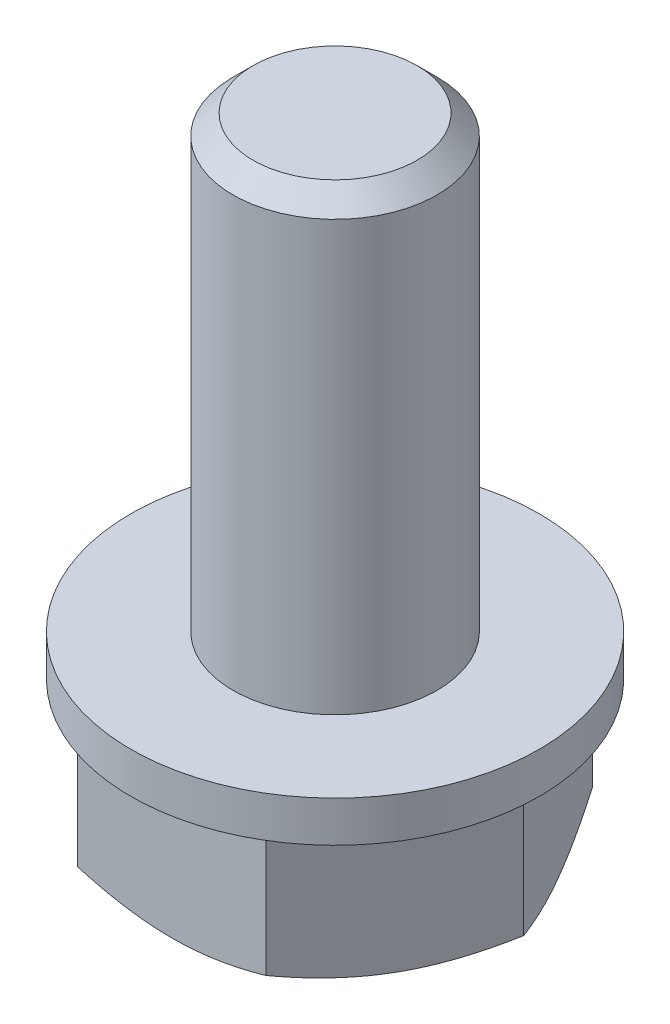
ISO-10303-21;
HEADER;
FILE_DESCRIPTION(('STEP AP214'),'2;1');
FILE_NAME('part.step','',(''),(''),'','','');
FILE_SCHEMA(('AUTOMOTIVE_DESIGN { 1 0 10303 214 1 1 1 1 }'));
ENDSEC;
DATA;
#1=APPLICATION_CONTEXT('core data for automotive mechanical design processes');
#2=APPLICATION_PROTOCOL_DEFINITION('international standard','automotive_design',2000,#1);
#3=PRODUCT_CONTEXT('',#1,'mechanical');
#4=PRODUCT('Part','Part','',(#3));
#5=PRODUCT_RELATED_PRODUCT_CATEGORY('part','',(#4));
#6=PRODUCT_DEFINITION_FORMATION('','',#4);
#7=PRODUCT_DEFINITION_CONTEXT('part definition',#1,'design');
#8=PRODUCT_DEFINITION('design','',#6,#7);
#9=PRODUCT_DEFINITION_SHAPE('','',#8);
#10=(LENGTH_UNIT() NAMED_UNIT(*) SI_UNIT(.MILLI.,.METRE.));
#11=(NAMED_UNIT(*) PLANE_ANGLE_UNIT() SI_UNIT($,.RADIAN.));
#12=(NAMED_UNIT(*) SI_UNIT($,.STERADIAN.) SOLID_ANGLE_UNIT());
#13=UNCERTAINTY_MEASURE_WITH_UNIT(LENGTH_MEASURE(1.E-05),#10,'distance_accuracy_value','');
#14=(GEOMETRIC_REPRESENTATION_CONTEXT(3) GLOBAL_UNCERTAINTY_ASSIGNED_CONTEXT((#13)) GLOBAL_UNIT_ASSIGNED_CONTEXT((#10,
#11,#12)) REPRESENTATION_CONTEXT('',''));
#15=CARTESIAN_POINT('',(0.,0.,0.));
#16=DIRECTION('',(0.,0.,1.));
#17=DIRECTION('',(1.,0.,0.));
#18=AXIS2_PLACEMENT_3D('',#15,#16,#17);
#19=CARTESIAN_POINT('',(12.374368670765,-45.18,-14.374368670765));
#20=DIRECTION('',(0.,-1.,0.));
#21=DIRECTION('',(0.,0.,-1.));
#22=AXIS2_PLACEMENT_3D('',#19,#20,#21);
#23=PLANE('',#22);
#24=CARTESIAN_POINT('',(12.374368670765,-45.18,-12.374368670765));
#25=DIRECTION('',(0.,-1.,0.));
#26=DIRECTION('',(0.,0.,-1.));
#27=AXIS2_PLACEMENT_3D('',#24,#25,#26);
#28=CIRCLE('',#27,4.);
#29=CARTESIAN_POINT('',(12.374368670765,-45.18,-16.374368670765));
#30=VERTEX_POINT('',#29);
#31=CARTESIAN_POINT('',(15.8384702859027,-45.18,-14.374368670765));
#32=VERTEX_POINT('',#31);
#33=EDGE_CURVE('E162',#30,#32,#28,.T.);
#34=ORIENTED_EDGE('',*,*,#33,.T.);
#35=CARTESIAN_POINT('',(12.374368670765,-45.18,-12.374368670765));
#36=DIRECTION('',(0.,-1.,0.));
#37=DIRECTION('',(0.,0.,-1.));
#38=AXIS2_PLACEMENT_3D('',#35,#36,#37);
#39=CIRCLE('',#38,4.);
#40=CARTESIAN_POINT('',(15.8384702859027,-45.18,-10.374368670765));
#41=VERTEX_POINT('',#40);
#42=EDGE_CURVE('E20',#32,#41,#39,.T.);
#43=ORIENTED_EDGE('',*,*,#42,.T.);
#44=CARTESIAN_POINT('',(12.374368670765,-45.18,-12.374368670765));
#45=DIRECTION('',(0.,-1.,0.));
#46=DIRECTION('',(0.,0.,-1.));
#47=AXIS2_PLACEMENT_3D('',#44,#45,#46);
#48=CIRCLE('',#47,4.);
#49=CARTESIAN_POINT('',(12.374368670765,-45.18,-8.374368670765));
#50=VERTEX_POINT('',#49);
#51=EDGE_CURVE('E130',#41,#50,#48,.T.);
#52=ORIENTED_EDGE('',*,*,#51,.T.);
#53=CARTESIAN_POINT('',(12.374368670765,-45.18,-12.374368670765));
#54=DIRECTION('',(0.,-1.,0.));
#55=DIRECTION('',(0.,0.,-1.));
#56=AXIS2_PLACEMENT_3D('',#53,#54,#55);
#57=CIRCLE('',#56,4.);
#58=CARTESIAN_POINT('',(8.91026705562725,-45.18,-10.374368670765));
#59=VERTEX_POINT('',#58);
#60=EDGE_CURVE('E101',#50,#59,#57,.T.);
#61=ORIENTED_EDGE('',*,*,#60,.T.);
#62=CARTESIAN_POINT('',(12.374368670765,-45.18,-12.374368670765));
#63=DIRECTION('',(0.,-1.,0.));
#64=DIRECTION('',(0.,0.,-1.));
#65=AXIS2_PLACEMENT_3D('',#62,#63,#64);
#66=CIRCLE('',#65,4.);
#67=CARTESIAN_POINT('',(8.91026705562725,-45.18,-14.374368670765));
#68=VERTEX_POINT('',#67);
#69=EDGE_CURVE('E149',#59,#68,#66,.T.);
#70=ORIENTED_EDGE('',*,*,#69,.T.);
#71=CARTESIAN_POINT('',(12.374368670765,-45.18,-12.374368670765));
#72=DIRECTION('',(0.,-1.,0.));
#73=DIRECTION('',(0.,0.,-1.));
#74=AXIS2_PLACEMENT_3D('',#71,#72,#73);
#75=CIRCLE('',#74,4.);
#76=EDGE_CURVE('E49',#68,#30,#75,.T.);
#77=ORIENTED_EDGE('',*,*,#76,.T.);
#78=EDGE_LOOP('',(#34,#43,#52,#61,#70,#77));
#79=FACE_BOUND('',#78,.T.);
#80=ADVANCED_FACE('F16',(#79),#23,.T.);
#81=CARTESIAN_POINT('',(12.374368670765,-42.6413248654052,-12.374368670765));
#82=DIRECTION('',(0.,1.,0.));
#83=DIRECTION('',(0.,0.,-1.));
#84=AXIS2_PLACEMENT_3D('',#81,#82,#83);
#85=CYLINDRICAL_SURFACE('',#84,5.);
#86=CARTESIAN_POINT('',(12.374368670765,-40.68,-12.374368670765));
#87=DIRECTION('',(0.,-1.,0.));
#88=DIRECTION('',(0.,0.,-1.));
#89=AXIS2_PLACEMENT_3D('',#86,#87,#88);
#90=CIRCLE('',#89,5.);
#91=CARTESIAN_POINT('',(12.374368670765,-40.68,-17.374368670765));
#92=VERTEX_POINT('',#91);
#93=EDGE_CURVE('E11',#92,#92,#90,.T.);
#94=ORIENTED_EDGE('',*,*,#93,.T.);
#95=EDGE_LOOP('',(#94));
#96=FACE_BOUND('',#95,.T.);
#97=CARTESIAN_POINT('',(12.374368670765,-41.68,-12.374368670765));
#98=DIRECTION('',(0.,1.,0.));
#99=DIRECTION('',(0.,0.,-1.));
#100=AXIS2_PLACEMENT_3D('',#97,#98,#99);
#101=CIRCLE('',#100,5.);
#102=CARTESIAN_POINT('',(12.374368670765,-41.68,-17.374368670765));
#103=VERTEX_POINT('',#102);
#104=EDGE_CURVE('E147',#103,#103,#101,.T.);
#105=ORIENTED_EDGE('',*,*,#104,.T.);
#106=EDGE_LOOP('',(#105));
#107=FACE_BOUND('',#106,.T.);
#108=ADVANCED_FACE('F296',(#96,#107),#85,.T.);
#109=CARTESIAN_POINT('',(12.374368670765,-40.68,-16.124368670765));
#110=DIRECTION('',(0.,1.,0.));
#111=DIRECTION('',(0.,0.,1.));
#112=AXIS2_PLACEMENT_3D('',#109,#110,#111);
#113=PLANE('',#112);
#114=CARTESIAN_POINT('',(12.374368670765,-40.68,-12.374368670765));
#115=DIRECTION('',(0.,-1.,0.));
#116=DIRECTION('',(0.,0.,-1.));
#117=AXIS2_PLACEMENT_3D('',#114,#115,#116);
#118=CIRCLE('',#117,2.5);
#119=CARTESIAN_POINT('',(12.374368670765,-40.68,-14.874368670765));
#120=VERTEX_POINT('',#119);
#121=EDGE_CURVE('E26',#120,#120,#118,.T.);
#122=ORIENTED_EDGE('',*,*,#121,.T.);
#123=EDGE_LOOP('',(#122));
#124=FACE_BOUND('',#123,.T.);
#125=ORIENTED_EDGE('',*,*,#93,.F.);
#126=EDGE_LOOP('',(#125));
#127=FACE_BOUND('',#126,.T.);
#128=ADVANCED_FACE('F301',(#124,#127),#113,.T.);
#129=CARTESIAN_POINT('',(12.374368670765,-35.42525,-12.374368670765));
#130=DIRECTION('',(0.,1.,0.));
#131=DIRECTION('',(0.,0.,-1.));
#132=AXIS2_PLACEMENT_3D('',#129,#130,#131);
#133=CYLINDRICAL_SURFACE('',#132,2.5);
#134=CARTESIAN_POINT('',(12.374368670765,-30.1705,-12.374368670765));
#135=DIRECTION('',(0.,-1.,0.));
#136=DIRECTION('',(0.,0.,-1.));
#137=AXIS2_PLACEMENT_3D('',#134,#135,#136);
#138=CIRCLE('',#137,2.5);
#139=CARTESIAN_POINT('',(12.374368670765,-30.1705,-14.874368670765));
#140=VERTEX_POINT('',#139);
#141=EDGE_CURVE('E186',#140,#140,#138,.T.);
#142=ORIENTED_EDGE('',*,*,#141,.T.);
#143=EDGE_LOOP('',(#142));
#144=FACE_BOUND('',#143,.T.);
#145=ORIENTED_EDGE('',*,*,#121,.F.);
#146=EDGE_LOOP('',(#145));
#147=FACE_BOUND('',#146,.T.);
#148=ADVANCED_FACE('F320',(#144,#147),#133,.T.);
#149=CARTESIAN_POINT('',(12.374368670765,-29.92525,-12.374368670765));
#150=DIRECTION('',(0.,-1.,0.));
#151=DIRECTION('',(0.,0.,-1.));
#152=AXIS2_PLACEMENT_3D('',#149,#150,#151);
#153=CONICAL_SURFACE('',#152,2.25475,0.785398163397448);
#154=CARTESIAN_POINT('',(12.374368670765,-29.68,-12.374368670765));
#155=DIRECTION('',(0.,-1.,0.));
#156=DIRECTION('',(0.,0.,-1.));
#157=AXIS2_PLACEMENT_3D('',#154,#155,#156);
#158=CIRCLE('',#157,2.0095);
#159=CARTESIAN_POINT('',(12.374368670765,-29.68,-14.383868670765));
#160=VERTEX_POINT('',#159);
#161=EDGE_CURVE('E159',#160,#160,#158,.T.);
#162=ORIENTED_EDGE('',*,*,#161,.T.);
#163=EDGE_LOOP('',(#162));
#164=FACE_BOUND('',#163,.T.);
#165=ORIENTED_EDGE('',*,*,#141,.F.);
#166=EDGE_LOOP('',(#165));
#167=FACE_BOUND('',#166,.T.);
#168=ADVANCED_FACE('F338',(#164,#167),#153,.T.);
#169=CARTESIAN_POINT('',(12.374368670765,-29.68,-13.379118670765));
#170=DIRECTION('',(0.,1.,0.));
#171=DIRECTION('',(0.,0.,1.));
#172=AXIS2_PLACEMENT_3D('',#169,#170,#171);
#173=PLANE('',#172);
#174=ORIENTED_EDGE('',*,*,#161,.F.);
#175=EDGE_LOOP('',(#174));
#176=FACE_BOUND('',#175,.T.);
#177=ADVANCED_FACE('F346',(#176),#173,.T.);
#178=CARTESIAN_POINT('',(12.374368670765,-44.8913248654052,-12.374368670765));
#179=DIRECTION('',(0.,1.,0.));
#180=DIRECTION('',(0.,0.,-1.));
#181=AXIS2_PLACEMENT_3D('',#178,#179,#180);
#182=CONICAL_SURFACE('',#181,4.5,1.04719755119662);
#183=CARTESIAN_POINT('',(12.374368670765,-45.18,-8.374368670765));
#184=CARTESIAN_POINT('',(11.302571901033,-45.18,-8.374368670765));
#185=CARTESIAN_POINT('',(10.0649675940065,-44.8227344100918,-8.37436867076499));
#186=(BOUNDED_CURVE() B_SPLINE_CURVE(2,(#183,#184,#185),.UNSPECIFIED.,.F.,
.F.) B_SPLINE_CURVE_WITH_KNOTS((3,3),(3.06610202231448,5.50179922142013),
.UNSPECIFIED.) CURVE() GEOMETRIC_REPRESENTATION_ITEM() RATIONAL_B_SPLINE_CURVE((1.,
1.04818815858901,1.01981541864881)) REPRESENTATION_ITEM(''));
#187=CARTESIAN_POINT('',(10.0649675940065,-44.8227344100919,-8.374368670765));
#188=VERTEX_POINT('',#187);
#189=EDGE_CURVE('E123',#50,#188,#186,.T.);
#190=ORIENTED_EDGE('',*,*,#189,.T.);
#191=CARTESIAN_POINT('',(10.0649675940065,-44.8227344100918,-8.374368670765));
#192=CARTESIAN_POINT('',(9.44616544048951,-45.1799999999999,-9.44616544048947));
#193=CARTESIAN_POINT('',(8.91026705562725,-45.18,-10.374368670765));
#194=(BOUNDED_CURVE() B_SPLINE_CURVE(2,(#191,#192,#193),.UNSPECIFIED.,.F.,
.F.) B_SPLINE_CURVE_WITH_KNOTS((3,3),(0.630404823226759,3.06610202231449),
.UNSPECIFIED.) CURVE() GEOMETRIC_REPRESENTATION_ITEM() RATIONAL_B_SPLINE_CURVE((1.01981541864924,
1.04818815858868,1.)) REPRESENTATION_ITEM(''));
#195=EDGE_CURVE('E154',#188,#59,#194,.T.);
#196=ORIENTED_EDGE('',*,*,#195,.T.);
#197=ORIENTED_EDGE('',*,*,#60,.F.);
#198=EDGE_LOOP('',(#190,#196,#197));
#199=FACE_BOUND('',#198,.T.);
#200=ADVANCED_FACE('F281',(#199),#182,.T.);
#201=CARTESIAN_POINT('',(12.374368670765,-44.8913248654052,-12.374368670765));
#202=DIRECTION('',(0.,1.,0.));
#203=DIRECTION('',(0.,0.,-1.));
#204=AXIS2_PLACEMENT_3D('',#201,#202,#203);
#205=CONICAL_SURFACE('',#204,4.5,1.04719755119662);
#206=CARTESIAN_POINT('',(15.8384702859027,-45.18,-10.374368670765));
#207=CARTESIAN_POINT('',(15.3025719010368,-45.18,-9.44616544048297));
#208=CARTESIAN_POINT('',(14.6837697475235,-44.8227344100919,-8.37436867076499));
#209=(BOUNDED_CURVE() B_SPLINE_CURVE(2,(#206,#207,#208),.UNSPECIFIED.,.F.,
.F.) B_SPLINE_CURVE_WITH_KNOTS((3,3),(3.06610202231449,5.50179922142015),
.UNSPECIFIED.) CURVE() GEOMETRIC_REPRESENTATION_ITEM() RATIONAL_B_SPLINE_CURVE((1.,
1.04818815858904,1.01981541864882)) REPRESENTATION_ITEM(''));
#210=CARTESIAN_POINT('',(14.6837697475235,-44.8227344100919,-8.374368670765));
#211=VERTEX_POINT('',#210);
#212=EDGE_CURVE('E126',#41,#211,#209,.T.);
#213=ORIENTED_EDGE('',*,*,#212,.T.);
#214=CARTESIAN_POINT('',(14.6837697475235,-44.8227344100919,-8.37436867076501));
#215=CARTESIAN_POINT('',(13.4461654404895,-45.1800000000001,-8.37436867076501));
#216=CARTESIAN_POINT('',(12.374368670765,-45.18,-8.374368670765));
#217=(BOUNDED_CURVE() B_SPLINE_CURVE(2,(#214,#215,#216),.UNSPECIFIED.,.F.,
.F.) B_SPLINE_CURVE_WITH_KNOTS((3,3),(0.630404823226771,3.06610202231448),
.UNSPECIFIED.) CURVE() GEOMETRIC_REPRESENTATION_ITEM() RATIONAL_B_SPLINE_CURVE((1.01981541864923,
1.04818815858865,1.)) REPRESENTATION_ITEM(''));
#218=EDGE_CURVE('E115',#211,#50,#217,.T.);
#219=ORIENTED_EDGE('',*,*,#218,.T.);
#220=ORIENTED_EDGE('',*,*,#51,.F.);
#221=EDGE_LOOP('',(#213,#219,#220));
#222=FACE_BOUND('',#221,.T.);
#223=ADVANCED_FACE('F129',(#222),#205,.T.);
#224=CARTESIAN_POINT('',(12.374368670765,-44.8913248654052,-12.374368670765));
#225=DIRECTION('',(0.,1.,0.));
#226=DIRECTION('',(0.,0.,-1.));
#227=AXIS2_PLACEMENT_3D('',#224,#225,#226);
#228=CONICAL_SURFACE('',#227,4.5,1.04719755119662);
#229=CARTESIAN_POINT('',(15.8384702859027,-45.18,-14.374368670765));
#230=CARTESIAN_POINT('',(16.3743686707688,-45.18,-13.446165440483));
#231=CARTESIAN_POINT('',(16.993170824282,-44.8227344100919,-12.374368670765));
#232=(BOUNDED_CURVE() B_SPLINE_CURVE(2,(#229,#230,#231),.UNSPECIFIED.,.F.,
.F.) B_SPLINE_CURVE_WITH_KNOTS((3,3),(3.06610202231449,5.50179922142014),
.UNSPECIFIED.) CURVE() GEOMETRIC_REPRESENTATION_ITEM() RATIONAL_B_SPLINE_CURVE((1.,
1.04818815858902,1.01981541864881)) REPRESENTATION_ITEM(''));
#233=CARTESIAN_POINT('',(16.993170824282,-44.8227344100919,-12.374368670765));
#234=VERTEX_POINT('',#233);
#235=EDGE_CURVE('E228',#32,#234,#232,.T.);
#236=ORIENTED_EDGE('',*,*,#235,.T.);
#237=CARTESIAN_POINT('',(16.993170824282,-44.8227344100919,-12.374368670765));
#238=CARTESIAN_POINT('',(16.374368670765,-45.1800000000001,-11.3025719010405));
#239=CARTESIAN_POINT('',(15.8384702859027,-45.18,-10.374368670765));
#240=(BOUNDED_CURVE() B_SPLINE_CURVE(2,(#237,#238,#239),.UNSPECIFIED.,.F.,
.F.) B_SPLINE_CURVE_WITH_KNOTS((3,3),(0.630404823226775,3.06610202231449),
.UNSPECIFIED.) CURVE() GEOMETRIC_REPRESENTATION_ITEM() RATIONAL_B_SPLINE_CURVE((1.01981541864923,
1.04818815858866,1.)) REPRESENTATION_ITEM(''));
#241=EDGE_CURVE('E139',#234,#41,#240,.T.);
#242=ORIENTED_EDGE('',*,*,#241,.T.);
#243=ORIENTED_EDGE('',*,*,#42,.F.);
#244=EDGE_LOOP('',(#236,#242,#243));
#245=FACE_BOUND('',#244,.T.);
#246=ADVANCED_FACE('F283',(#245),#228,.T.);
#247=CARTESIAN_POINT('',(12.374368670765,-44.8913248654052,-12.374368670765));
#248=DIRECTION('',(0.,1.,0.));
#249=DIRECTION('',(0.,0.,-1.));
#250=AXIS2_PLACEMENT_3D('',#247,#248,#249);
#251=CONICAL_SURFACE('',#250,4.5,1.04719755119662);
#252=CARTESIAN_POINT('',(14.6837697475235,-44.8227344100918,-16.374368670765));
#253=CARTESIAN_POINT('',(15.3025719010405,-45.1799999999999,-15.3025719010405));
#254=CARTESIAN_POINT('',(15.8384702859027,-45.18,-14.374368670765));
#255=(BOUNDED_CURVE() B_SPLINE_CURVE(2,(#252,#253,#254),.UNSPECIFIED.,.F.,
.F.) B_SPLINE_CURVE_WITH_KNOTS((3,3),(0.630404823226759,3.06610202231449),
.UNSPECIFIED.) CURVE() GEOMETRIC_REPRESENTATION_ITEM() RATIONAL_B_SPLINE_CURVE((1.01981541864924,
1.04818815858868,1.)) REPRESENTATION_ITEM(''));
#256=CARTESIAN_POINT('',(14.6837697475235,-44.8227344100919,-16.374368670765));
#257=VERTEX_POINT('',#256);
#258=EDGE_CURVE('E188',#257,#32,#255,.T.);
#259=ORIENTED_EDGE('',*,*,#258,.T.);
#260=ORIENTED_EDGE('',*,*,#33,.F.);
#261=CARTESIAN_POINT('',(12.374368670765,-45.18,-16.374368670765));
#262=CARTESIAN_POINT('',(13.446165440497,-45.18,-16.374368670765));
#263=CARTESIAN_POINT('',(14.6837697475235,-44.8227344100918,-16.374368670765));
#264=(BOUNDED_CURVE() B_SPLINE_CURVE(2,(#261,#262,#263),.UNSPECIFIED.,.F.,
.F.) B_SPLINE_CURVE_WITH_KNOTS((3,3),(3.06610202231448,5.50179922142013),
.UNSPECIFIED.) CURVE() GEOMETRIC_REPRESENTATION_ITEM() RATIONAL_B_SPLINE_CURVE((1.,
1.04818815858901,1.01981541864881)) REPRESENTATION_ITEM(''));
#265=EDGE_CURVE('E201',#30,#257,#264,.T.);
#266=ORIENTED_EDGE('',*,*,#265,.T.);
#267=EDGE_LOOP('',(#259,#260,#266));
#268=FACE_BOUND('',#267,.T.);
#269=ADVANCED_FACE('F277',(#268),#251,.T.);
#270=CARTESIAN_POINT('',(12.374368670765,-44.8913248654052,-12.374368670765));
#271=DIRECTION('',(0.,1.,0.));
#272=DIRECTION('',(0.,0.,-1.));
#273=AXIS2_PLACEMENT_3D('',#270,#271,#272);
#274=CONICAL_SURFACE('',#273,4.5,1.04719755119662);
#275=CARTESIAN_POINT('',(10.0649675940065,-44.8227344100919,-16.374368670765));
#276=CARTESIAN_POINT('',(11.3025719010405,-45.1800000000001,-16.374368670765));
#277=CARTESIAN_POINT('',(12.374368670765,-45.18,-16.374368670765));
#278=(BOUNDED_CURVE() B_SPLINE_CURVE(2,(#275,#276,#277),.UNSPECIFIED.,.F.,
.F.) B_SPLINE_CURVE_WITH_KNOTS((3,3),(0.630404823226771,3.06610202231448),
.UNSPECIFIED.) CURVE() GEOMETRIC_REPRESENTATION_ITEM() RATIONAL_B_SPLINE_CURVE((1.01981541864923,
1.04818815858865,1.)) REPRESENTATION_ITEM(''));
#279=CARTESIAN_POINT('',(10.0649675940065,-44.8227344100919,-16.374368670765));
#280=VERTEX_POINT('',#279);
#281=EDGE_CURVE('E193',#280,#30,#278,.T.);
#282=ORIENTED_EDGE('',*,*,#281,.T.);
#283=ORIENTED_EDGE('',*,*,#76,.F.);
#284=CARTESIAN_POINT('',(8.91026705562725,-45.18,-14.374368670765));
#285=CARTESIAN_POINT('',(9.44616544049328,-45.18,-15.3025719010471));
#286=CARTESIAN_POINT('',(10.0649675940065,-44.8227344100919,-16.374368670765));
#287=(BOUNDED_CURVE() B_SPLINE_CURVE(2,(#284,#285,#286),.UNSPECIFIED.,.F.,
.F.) B_SPLINE_CURVE_WITH_KNOTS((3,3),(3.06610202231449,5.50179922142015),
.UNSPECIFIED.) CURVE() GEOMETRIC_REPRESENTATION_ITEM() RATIONAL_B_SPLINE_CURVE((1.,
1.04818815858904,1.01981541864882)) REPRESENTATION_ITEM(''));
#288=EDGE_CURVE('E167',#68,#280,#287,.T.);
#289=ORIENTED_EDGE('',*,*,#288,.T.);
#290=EDGE_LOOP('',(#282,#283,#289));
#291=FACE_BOUND('',#290,.T.);
#292=ADVANCED_FACE('F273',(#291),#274,.T.);
#293=CARTESIAN_POINT('',(12.374368670765,-44.8913248654052,-12.374368670765));
#294=DIRECTION('',(0.,1.,0.));
#295=DIRECTION('',(0.,0.,-1.));
#296=AXIS2_PLACEMENT_3D('',#293,#294,#295);
#297=CONICAL_SURFACE('',#296,4.5,1.04719755119662);
#298=CARTESIAN_POINT('',(7.755566517248,-44.8227344100919,-12.374368670765));
#299=CARTESIAN_POINT('',(8.37436867076501,-45.1800000000001,-13.4461654404895));
#300=CARTESIAN_POINT('',(8.91026705562725,-45.18,-14.374368670765));
#301=(BOUNDED_CURVE() B_SPLINE_CURVE(2,(#298,#299,#300),.UNSPECIFIED.,.F.,
.F.) B_SPLINE_CURVE_WITH_KNOTS((3,3),(0.630404823226775,3.06610202231449),
.UNSPECIFIED.) CURVE() GEOMETRIC_REPRESENTATION_ITEM() RATIONAL_B_SPLINE_CURVE((1.01981541864923,
1.04818815858866,1.)) REPRESENTATION_ITEM(''));
#302=CARTESIAN_POINT('',(7.755566517248,-44.8227344100919,-12.374368670765));
#303=VERTEX_POINT('',#302);
#304=EDGE_CURVE('E164',#303,#68,#301,.T.);
#305=ORIENTED_EDGE('',*,*,#304,.T.);
#306=ORIENTED_EDGE('',*,*,#69,.F.);
#307=CARTESIAN_POINT('',(8.91026705562725,-45.18,-10.374368670765));
#308=CARTESIAN_POINT('',(8.37436867076123,-45.18,-11.302571901047));
#309=CARTESIAN_POINT('',(7.75556651724801,-44.8227344100919,-12.374368670765));
#310=(BOUNDED_CURVE() B_SPLINE_CURVE(2,(#307,#308,#309),.UNSPECIFIED.,.F.,
.F.) B_SPLINE_CURVE_WITH_KNOTS((3,3),(3.06610202231449,5.50179922142014),
.UNSPECIFIED.) CURVE() GEOMETRIC_REPRESENTATION_ITEM() RATIONAL_B_SPLINE_CURVE((1.,
1.04818815858902,1.01981541864881)) REPRESENTATION_ITEM(''));
#311=EDGE_CURVE('E150',#59,#303,#310,.T.);
#312=ORIENTED_EDGE('',*,*,#311,.T.);
#313=EDGE_LOOP('',(#305,#306,#312));
#314=FACE_BOUND('',#313,.T.);
#315=ADVANCED_FACE('F279',(#314),#297,.T.);
#316=CARTESIAN_POINT('',(12.374368670765,-41.68,-12.374368670765));
#317=DIRECTION('',(0.,-1.,0.));
#318=DIRECTION('',(-1.,0.,0.));
#319=AXIS2_PLACEMENT_3D('',#316,#317,#318);
#320=PLANE('',#319);
#321=DIRECTION('',(0.5,0.,-0.866025403784439));
#322=VECTOR('',#321,1.);
#323=CARTESIAN_POINT('',(16.993170824282,-41.68,-12.374368670765));
#324=LINE('',#323,#322);
#325=CARTESIAN_POINT('',(14.6837697475235,-41.68,-8.374368670765));
#326=VERTEX_POINT('',#325);
#327=CARTESIAN_POINT('',(16.993170824282,-41.68,-12.374368670765));
#328=VERTEX_POINT('',#327);
#329=EDGE_CURVE('E137',#326,#328,#324,.T.);
#330=ORIENTED_EDGE('',*,*,#329,.T.);
#331=DIRECTION('',(-0.5,0.,-0.866025403784439));
#332=VECTOR('',#331,1.);
#333=CARTESIAN_POINT('',(14.6837697475235,-41.68,-16.374368670765));
#334=LINE('',#333,#332);
#335=CARTESIAN_POINT('',(14.6837697475235,-41.68,-16.374368670765));
#336=VERTEX_POINT('',#335);
#337=EDGE_CURVE('E177',#328,#336,#334,.T.);
#338=ORIENTED_EDGE('',*,*,#337,.T.);
#339=DIRECTION('',(-1.,0.,0.));
#340=VECTOR('',#339,1.);
#341=CARTESIAN_POINT('',(10.0649675940065,-41.68,-16.374368670765));
#342=LINE('',#341,#340);
#343=CARTESIAN_POINT('',(10.0649675940065,-41.68,-16.374368670765));
#344=VERTEX_POINT('',#343);
#345=EDGE_CURVE('E171',#336,#344,#342,.T.);
#346=ORIENTED_EDGE('',*,*,#345,.T.);
#347=DIRECTION('',(-0.5,0.,0.866025403784439));
#348=VECTOR('',#347,1.);
#349=CARTESIAN_POINT('',(7.755566517248,-41.68,-12.374368670765));
#350=LINE('',#349,#348);
#351=CARTESIAN_POINT('',(7.755566517248,-41.68,-12.374368670765));
#352=VERTEX_POINT('',#351);
#353=EDGE_CURVE('E61',#344,#352,#350,.T.);
#354=ORIENTED_EDGE('',*,*,#353,.T.);
#355=DIRECTION('',(0.5,0.,0.866025403784439));
#356=VECTOR('',#355,1.);
#357=CARTESIAN_POINT('',(10.0649675940065,-41.68,-8.374368670765));
#358=LINE('',#357,#356);
#359=CARTESIAN_POINT('',(10.0649675940065,-41.68,-8.374368670765));
#360=VERTEX_POINT('',#359);
#361=EDGE_CURVE('E95',#352,#360,#358,.T.);
#362=ORIENTED_EDGE('',*,*,#361,.T.);
#363=DIRECTION('',(1.,0.,0.));
#364=VECTOR('',#363,1.);
#365=CARTESIAN_POINT('',(14.6837697475235,-41.68,-8.374368670765));
#366=LINE('',#365,#364);
#367=EDGE_CURVE('E125',#360,#326,#366,.T.);
#368=ORIENTED_EDGE('',*,*,#367,.T.);
#369=EDGE_LOOP('',(#330,#338,#346,#354,#362,#368));
#370=FACE_BOUND('',#369,.T.);
#371=ORIENTED_EDGE('',*,*,#104,.F.);
#372=EDGE_LOOP('',(#371));
#373=FACE_BOUND('',#372,.T.);
#374=ADVANCED_FACE('F264',(#370,#373),#320,.T.);
#375=CARTESIAN_POINT('',(7.755566517248,-45.18,-12.374368670765));
#376=DIRECTION('',(0.866025403784439,0.,-0.5));
#377=DIRECTION('',(-0.5,0.,-0.866025403784439));
#378=AXIS2_PLACEMENT_3D('',#375,#376,#377);
#379=PLANE('',#378);
#380=ORIENTED_EDGE('',*,*,#311,.F.);
#381=ORIENTED_EDGE('',*,*,#195,.F.);
#382=DIRECTION('',(0.,1.,0.));
#383=VECTOR('',#382,1.);
#384=CARTESIAN_POINT('',(10.0649675940065,-45.18,-8.374368670765));
#385=LINE('',#384,#383);
#386=EDGE_CURVE('E145',#188,#360,#385,.T.);
#387=ORIENTED_EDGE('',*,*,#386,.T.);
#388=ORIENTED_EDGE('',*,*,#361,.F.);
#389=DIRECTION('',(0.,1.,0.));
#390=VECTOR('',#389,1.);
#391=CARTESIAN_POINT('',(7.755566517248,-45.18,-12.374368670765));
#392=LINE('',#391,#390);
#393=EDGE_CURVE('E161',#303,#352,#392,.T.);
#394=ORIENTED_EDGE('',*,*,#393,.F.);
#395=EDGE_LOOP('',(#380,#381,#387,#388,#394));
#396=FACE_BOUND('',#395,.T.);
#397=ADVANCED_FACE('F262',(#396),#379,.F.);
#398=CARTESIAN_POINT('',(10.0649675940065,-45.18,-16.374368670765));
#399=DIRECTION('',(0.866025403784439,0.,0.5));
#400=DIRECTION('',(0.5,0.,-0.866025403784439));
#401=AXIS2_PLACEMENT_3D('',#398,#399,#400);
#402=PLANE('',#401);
#403=ORIENTED_EDGE('',*,*,#288,.F.);
#404=ORIENTED_EDGE('',*,*,#304,.F.);
#405=ORIENTED_EDGE('',*,*,#393,.T.);
#406=ORIENTED_EDGE('',*,*,#353,.F.);
#407=DIRECTION('',(0.,1.,0.));
#408=VECTOR('',#407,1.);
#409=CARTESIAN_POINT('',(10.0649675940065,-45.18,-16.374368670765));
#410=LINE('',#409,#408);
#411=EDGE_CURVE('E200',#280,#344,#410,.T.);
#412=ORIENTED_EDGE('',*,*,#411,.F.);
#413=EDGE_LOOP('',(#403,#404,#405,#406,#412));
#414=FACE_BOUND('',#413,.T.);
#415=ADVANCED_FACE('F272',(#414),#402,.F.);
#416=CARTESIAN_POINT('',(14.6837697475235,-45.18,-16.374368670765));
#417=DIRECTION('',(0.,0.,1.));
#418=DIRECTION('',(1.,0.,0.));
#419=AXIS2_PLACEMENT_3D('',#416,#417,#418);
#420=PLANE('',#419);
#421=ORIENTED_EDGE('',*,*,#265,.F.);
#422=ORIENTED_EDGE('',*,*,#281,.F.);
#423=ORIENTED_EDGE('',*,*,#411,.T.);
#424=ORIENTED_EDGE('',*,*,#345,.F.);
#425=DIRECTION('',(0.,1.,0.));
#426=VECTOR('',#425,1.);
#427=CARTESIAN_POINT('',(14.6837697475235,-45.18,-16.374368670765));
#428=LINE('',#427,#426);
#429=EDGE_CURVE('E184',#257,#336,#428,.T.);
#430=ORIENTED_EDGE('',*,*,#429,.F.);
#431=EDGE_LOOP('',(#421,#422,#423,#424,#430));
#432=FACE_BOUND('',#431,.T.);
#433=ADVANCED_FACE('F271',(#432),#420,.F.);
#434=CARTESIAN_POINT('',(10.0649675940065,-45.18,-8.374368670765));
#435=DIRECTION('',(0.,0.,-1.));
#436=DIRECTION('',(-1.,0.,0.));
#437=AXIS2_PLACEMENT_3D('',#434,#435,#436);
#438=PLANE('',#437);
#439=ORIENTED_EDGE('',*,*,#218,.F.);
#440=DIRECTION('',(0.,1.,0.));
#441=VECTOR('',#440,1.);
#442=CARTESIAN_POINT('',(14.6837697475235,-45.18,-8.374368670765));
#443=LINE('',#442,#441);
#444=EDGE_CURVE('E119',#211,#326,#443,.T.);
#445=ORIENTED_EDGE('',*,*,#444,.T.);
#446=ORIENTED_EDGE('',*,*,#367,.F.);
#447=ORIENTED_EDGE('',*,*,#386,.F.);
#448=ORIENTED_EDGE('',*,*,#189,.F.);
#449=EDGE_LOOP('',(#439,#445,#446,#447,#448));
#450=FACE_BOUND('',#449,.T.);
#451=ADVANCED_FACE('F18',(#450),#438,.F.);
#452=CARTESIAN_POINT('',(14.6837697475235,-45.18,-8.374368670765));
#453=DIRECTION('',(-0.866025403784439,0.,-0.5));
#454=DIRECTION('',(-0.5,0.,0.866025403784439));
#455=AXIS2_PLACEMENT_3D('',#452,#453,#454);
#456=PLANE('',#455);
#457=ORIENTED_EDGE('',*,*,#241,.F.);
#458=DIRECTION('',(0.,1.,0.));
#459=VECTOR('',#458,1.);
#460=CARTESIAN_POINT('',(16.993170824282,-45.18,-12.374368670765));
#461=LINE('',#460,#459);
#462=EDGE_CURVE('E183',#234,#328,#461,.T.);
#463=ORIENTED_EDGE('',*,*,#462,.T.);
#464=ORIENTED_EDGE('',*,*,#329,.F.);
#465=ORIENTED_EDGE('',*,*,#444,.F.);
#466=ORIENTED_EDGE('',*,*,#212,.F.);
#467=EDGE_LOOP('',(#457,#463,#464,#465,#466));
#468=FACE_BOUND('',#467,.T.);
#469=ADVANCED_FACE('F135',(#468),#456,.F.);
#470=CARTESIAN_POINT('',(16.993170824282,-45.18,-12.374368670765));
#471=DIRECTION('',(-0.866025403784439,0.,0.5));
#472=DIRECTION('',(0.5,0.,0.866025403784439));
#473=AXIS2_PLACEMENT_3D('',#470,#471,#472);
#474=PLANE('',#473);
#475=ORIENTED_EDGE('',*,*,#258,.F.);
#476=ORIENTED_EDGE('',*,*,#429,.T.);
#477=ORIENTED_EDGE('',*,*,#337,.F.);
#478=ORIENTED_EDGE('',*,*,#462,.F.);
#479=ORIENTED_EDGE('',*,*,#235,.F.);
#480=EDGE_LOOP('',(#475,#476,#477,#478,#479));
#481=FACE_BOUND('',#480,.T.);
#482=ADVANCED_FACE('F286',(#481),#474,.F.);
#483=CLOSED_SHELL('',(#80,#108,#128,#148,#168,#177,#200,#223,#246,#269,#292,#315,#374,#397,#415,
#433,#451,#469,#482));
#484=MANIFOLD_SOLID_BREP('B1',#483);
#485=ADVANCED_BREP_SHAPE_REPRESENTATION('',(#18,#484),#14);
#486=SHAPE_DEFINITION_REPRESENTATION(#9,#485);
ENDSEC;
END-ISO-10303-21;
